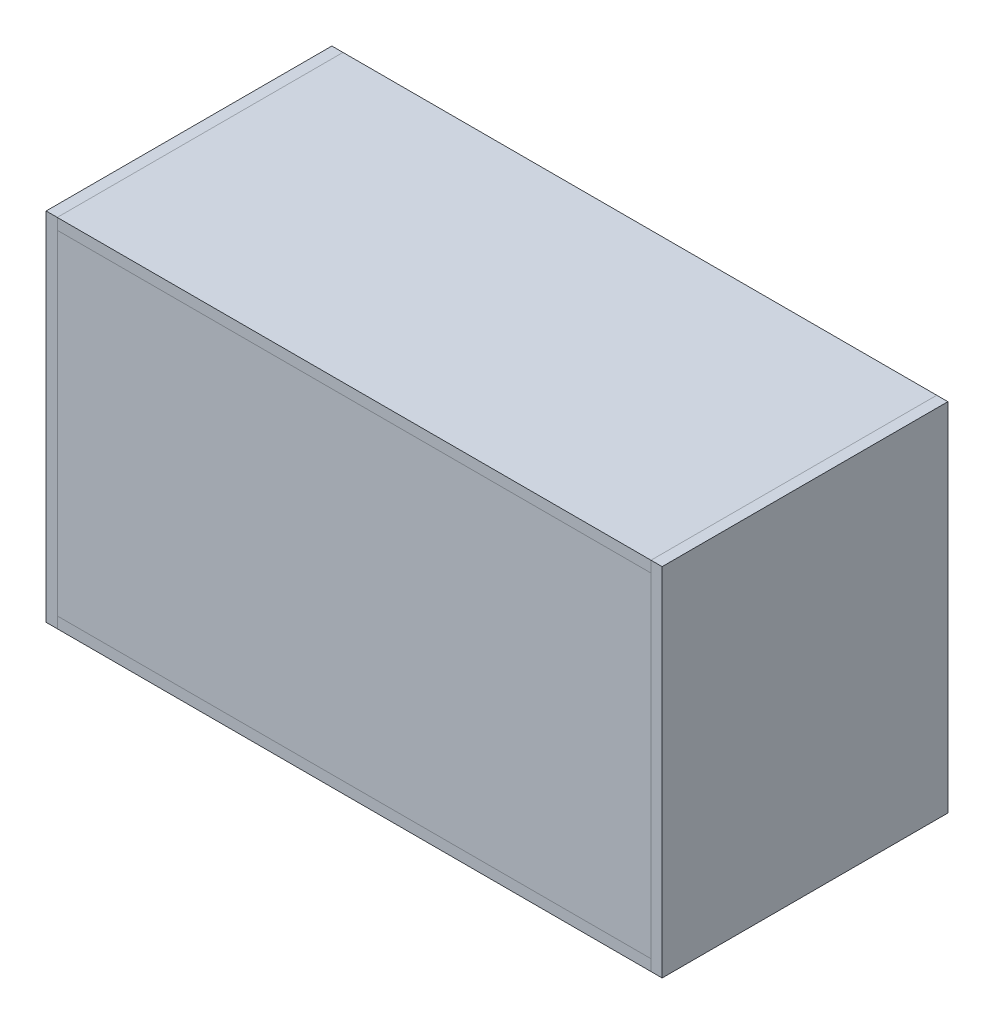
ISO-10303-21;
HEADER;
FILE_DESCRIPTION(('STEP AP214'),'2;1');
FILE_NAME('part.step','',(''),(''),'','','');
FILE_SCHEMA(('AUTOMOTIVE_DESIGN { 1 0 10303 214 1 1 1 1 }'));
ENDSEC;
DATA;
#1=APPLICATION_CONTEXT('core data for automotive mechanical design processes');
#2=APPLICATION_PROTOCOL_DEFINITION('international standard','automotive_design',2000,#1);
#3=PRODUCT_CONTEXT('',#1,'mechanical');
#4=PRODUCT('Part','Part','',(#3));
#5=PRODUCT_RELATED_PRODUCT_CATEGORY('part','',(#4));
#6=PRODUCT_DEFINITION_FORMATION('','',#4);
#7=PRODUCT_DEFINITION_CONTEXT('part definition',#1,'design');
#8=PRODUCT_DEFINITION('design','',#6,#7);
#9=PRODUCT_DEFINITION_SHAPE('','',#8);
#10=(LENGTH_UNIT() NAMED_UNIT(*) SI_UNIT(.MILLI.,.METRE.));
#11=(NAMED_UNIT(*) PLANE_ANGLE_UNIT() SI_UNIT($,.RADIAN.));
#12=(NAMED_UNIT(*) SI_UNIT($,.STERADIAN.) SOLID_ANGLE_UNIT());
#13=UNCERTAINTY_MEASURE_WITH_UNIT(LENGTH_MEASURE(1.E-05),#10,'distance_accuracy_value','');
#14=(GEOMETRIC_REPRESENTATION_CONTEXT(3) GLOBAL_UNCERTAINTY_ASSIGNED_CONTEXT((#13)) GLOBAL_UNIT_ASSIGNED_CONTEXT((#10,
#11,#12)) REPRESENTATION_CONTEXT('',''));
#15=CARTESIAN_POINT('',(0.,0.,0.));
#16=DIRECTION('',(0.,0.,1.));
#17=DIRECTION('',(1.,0.,0.));
#18=AXIS2_PLACEMENT_3D('',#15,#16,#17);
#19=CARTESIAN_POINT('',(508.,0.,-225.425));
#20=DIRECTION('',(1.,0.,0.));
#21=DIRECTION('',(0.,0.,1.));
#22=AXIS2_PLACEMENT_3D('',#19,#20,#21);
#23=PLANE('',#22);
#24=DIRECTION('',(0.,1.,0.));
#25=VECTOR('',#24,1.);
#26=CARTESIAN_POINT('',(508.,0.,-244.475));
#27=LINE('',#26,#25);
#28=CARTESIAN_POINT('',(508.,0.,-244.475));
#29=VERTEX_POINT('',#28);
#30=CARTESIAN_POINT('',(508.,571.5,-244.475));
#31=VERTEX_POINT('',#30);
#32=EDGE_CURVE('E114',#29,#31,#27,.T.);
#33=ORIENTED_EDGE('',*,*,#32,.T.);
#34=DIRECTION('',(0.,0.,-1.));
#35=VECTOR('',#34,1.);
#36=CARTESIAN_POINT('',(508.,571.5,-225.425));
#37=LINE('',#36,#35);
#38=CARTESIAN_POINT('',(508.,571.5,-225.425));
#39=VERTEX_POINT('',#38);
#40=EDGE_CURVE('E53',#39,#31,#37,.T.);
#41=ORIENTED_EDGE('',*,*,#40,.F.);
#42=DIRECTION('',(0.,1.,0.));
#43=VECTOR('',#42,1.);
#44=CARTESIAN_POINT('',(508.,0.,-225.425));
#45=LINE('',#44,#43);
#46=CARTESIAN_POINT('',(508.,0.,-225.425));
#47=VERTEX_POINT('',#46);
#48=EDGE_CURVE('E103',#47,#39,#45,.T.);
#49=ORIENTED_EDGE('',*,*,#48,.F.);
#50=DIRECTION('',(0.,0.,-1.));
#51=VECTOR('',#50,1.);
#52=CARTESIAN_POINT('',(508.,0.,-225.425));
#53=LINE('',#52,#51);
#54=EDGE_CURVE('E12',#47,#29,#53,.T.);
#55=ORIENTED_EDGE('',*,*,#54,.T.);
#56=EDGE_LOOP('',(#33,#41,#49,#55));
#57=FACE_BOUND('',#56,.T.);
#58=ADVANCED_FACE('F50',(#57),#23,.T.);
#59=CARTESIAN_POINT('',(508.,0.,-225.425));
#60=DIRECTION('',(0.,-1.,0.));
#61=DIRECTION('',(0.,0.,1.));
#62=AXIS2_PLACEMENT_3D('',#59,#60,#61);
#63=PLANE('',#62);
#64=DIRECTION('',(1.,0.,0.));
#65=VECTOR('',#64,1.);
#66=CARTESIAN_POINT('',(508.,0.,-244.475));
#67=LINE('',#66,#65);
#68=CARTESIAN_POINT('',(-508.,0.,-244.475));
#69=VERTEX_POINT('',#68);
#70=EDGE_CURVE('E91',#69,#29,#67,.T.);
#71=ORIENTED_EDGE('',*,*,#70,.T.);
#72=ORIENTED_EDGE('',*,*,#54,.F.);
#73=DIRECTION('',(1.,0.,0.));
#74=VECTOR('',#73,1.);
#75=CARTESIAN_POINT('',(508.,0.,-225.425));
#76=LINE('',#75,#74);
#77=CARTESIAN_POINT('',(-508.,0.,-225.425));
#78=VERTEX_POINT('',#77);
#79=EDGE_CURVE('E68',#78,#47,#76,.T.);
#80=ORIENTED_EDGE('',*,*,#79,.F.);
#81=DIRECTION('',(0.,0.,-1.));
#82=VECTOR('',#81,1.);
#83=CARTESIAN_POINT('',(-508.,0.,-225.425));
#84=LINE('',#83,#82);
#85=EDGE_CURVE('E59',#78,#69,#84,.T.);
#86=ORIENTED_EDGE('',*,*,#85,.T.);
#87=EDGE_LOOP('',(#71,#72,#80,#86));
#88=FACE_BOUND('',#87,.T.);
#89=ADVANCED_FACE('F120',(#88),#63,.T.);
#90=CARTESIAN_POINT('',(-508.,0.,-225.425));
#91=DIRECTION('',(-1.,0.,0.));
#92=DIRECTION('',(0.,0.,-1.));
#93=AXIS2_PLACEMENT_3D('',#90,#91,#92);
#94=PLANE('',#93);
#95=DIRECTION('',(0.,-1.,0.));
#96=VECTOR('',#95,1.);
#97=CARTESIAN_POINT('',(-508.,0.,-244.475));
#98=LINE('',#97,#96);
#99=CARTESIAN_POINT('',(-508.,571.5,-244.475));
#100=VERTEX_POINT('',#99);
#101=EDGE_CURVE('E85',#100,#69,#98,.T.);
#102=ORIENTED_EDGE('',*,*,#101,.T.);
#103=ORIENTED_EDGE('',*,*,#85,.F.);
#104=DIRECTION('',(0.,-1.,0.));
#105=VECTOR('',#104,1.);
#106=CARTESIAN_POINT('',(-508.,0.,-225.425));
#107=LINE('',#106,#105);
#108=CARTESIAN_POINT('',(-508.,571.5,-225.425));
#109=VERTEX_POINT('',#108);
#110=EDGE_CURVE('E101',#109,#78,#107,.T.);
#111=ORIENTED_EDGE('',*,*,#110,.F.);
#112=DIRECTION('',(0.,0.,-1.));
#113=VECTOR('',#112,1.);
#114=CARTESIAN_POINT('',(-508.,571.5,-225.425));
#115=LINE('',#114,#113);
#116=EDGE_CURVE('E106',#109,#100,#115,.T.);
#117=ORIENTED_EDGE('',*,*,#116,.T.);
#118=EDGE_LOOP('',(#102,#103,#111,#117));
#119=FACE_BOUND('',#118,.T.);
#120=ADVANCED_FACE('F109',(#119),#94,.T.);
#121=CARTESIAN_POINT('',(508.,571.5,-225.425));
#122=DIRECTION('',(0.,1.,0.));
#123=DIRECTION('',(-1.,0.,0.));
#124=AXIS2_PLACEMENT_3D('',#121,#122,#123);
#125=PLANE('',#124);
#126=DIRECTION('',(-1.,0.,0.));
#127=VECTOR('',#126,1.);
#128=CARTESIAN_POINT('',(508.,571.5,-244.475));
#129=LINE('',#128,#127);
#130=EDGE_CURVE('E108',#31,#100,#129,.T.);
#131=ORIENTED_EDGE('',*,*,#130,.T.);
#132=ORIENTED_EDGE('',*,*,#116,.F.);
#133=DIRECTION('',(-1.,0.,0.));
#134=VECTOR('',#133,1.);
#135=CARTESIAN_POINT('',(508.,571.5,-225.425));
#136=LINE('',#135,#134);
#137=EDGE_CURVE('E98',#39,#109,#136,.T.);
#138=ORIENTED_EDGE('',*,*,#137,.F.);
#139=ORIENTED_EDGE('',*,*,#40,.T.);
#140=EDGE_LOOP('',(#131,#132,#138,#139));
#141=FACE_BOUND('',#140,.T.);
#142=ADVANCED_FACE('F107',(#141),#125,.T.);
#143=CARTESIAN_POINT('',(0.,0.,-225.425));
#144=DIRECTION('',(0.,0.,-1.));
#145=DIRECTION('',(1.,0.,0.));
#146=AXIS2_PLACEMENT_3D('',#143,#144,#145);
#147=PLANE('',#146);
#148=ORIENTED_EDGE('',*,*,#48,.T.);
#149=ORIENTED_EDGE('',*,*,#137,.T.);
#150=ORIENTED_EDGE('',*,*,#110,.T.);
#151=ORIENTED_EDGE('',*,*,#79,.T.);
#152=EDGE_LOOP('',(#148,#149,#150,#151));
#153=FACE_BOUND('',#152,.T.);
#154=ADVANCED_FACE('F99',(#153),#147,.F.);
#155=CARTESIAN_POINT('',(0.,0.,-244.475));
#156=DIRECTION('',(0.,0.,-1.));
#157=DIRECTION('',(1.,0.,0.));
#158=AXIS2_PLACEMENT_3D('',#155,#156,#157);
#159=PLANE('',#158);
#160=ORIENTED_EDGE('',*,*,#32,.F.);
#161=ORIENTED_EDGE('',*,*,#70,.F.);
#162=ORIENTED_EDGE('',*,*,#101,.F.);
#163=ORIENTED_EDGE('',*,*,#130,.F.);
#164=EDGE_LOOP('',(#160,#161,#162,#163));
#165=FACE_BOUND('',#164,.T.);
#166=ADVANCED_FACE('F123',(#165),#159,.T.);
#167=CLOSED_SHELL('',(#58,#89,#120,#142,#154,#166));
#168=MANIFOLD_SOLID_BREP('B2',#167);
#169=CARTESIAN_POINT('',(508.,0.,225.425));
#170=DIRECTION('',(1.,0.,0.));
#171=DIRECTION('',(0.,0.,-1.));
#172=AXIS2_PLACEMENT_3D('',#169,#170,#171);
#173=PLANE('',#172);
#174=DIRECTION('',(0.,1.,0.));
#175=VECTOR('',#174,1.);
#176=CARTESIAN_POINT('',(508.,0.,244.475));
#177=LINE('',#176,#175);
#178=CARTESIAN_POINT('',(508.,0.,244.475));
#179=VERTEX_POINT('',#178);
#180=CARTESIAN_POINT('',(508.,571.5,244.475));
#181=VERTEX_POINT('',#180);
#182=EDGE_CURVE('E248',#179,#181,#177,.T.);
#183=ORIENTED_EDGE('',*,*,#182,.F.);
#184=DIRECTION('',(0.,0.,1.));
#185=VECTOR('',#184,1.);
#186=CARTESIAN_POINT('',(508.,0.,225.425));
#187=LINE('',#186,#185);
#188=CARTESIAN_POINT('',(508.,0.,225.425));
#189=VERTEX_POINT('',#188);
#190=EDGE_CURVE('E48',#189,#179,#187,.T.);
#191=ORIENTED_EDGE('',*,*,#190,.F.);
#192=DIRECTION('',(0.,1.,0.));
#193=VECTOR('',#192,1.);
#194=CARTESIAN_POINT('',(508.,0.,225.425));
#195=LINE('',#194,#193);
#196=CARTESIAN_POINT('',(508.,571.5,225.425));
#197=VERTEX_POINT('',#196);
#198=EDGE_CURVE('E242',#189,#197,#195,.T.);
#199=ORIENTED_EDGE('',*,*,#198,.T.);
#200=DIRECTION('',(0.,0.,1.));
#201=VECTOR('',#200,1.);
#202=CARTESIAN_POINT('',(508.,571.5,225.425));
#203=LINE('',#202,#201);
#204=EDGE_CURVE('E187',#197,#181,#203,.T.);
#205=ORIENTED_EDGE('',*,*,#204,.T.);
#206=EDGE_LOOP('',(#183,#191,#199,#205));
#207=FACE_BOUND('',#206,.T.);
#208=ADVANCED_FACE('F184',(#207),#173,.T.);
#209=CARTESIAN_POINT('',(508.,0.,225.425));
#210=DIRECTION('',(0.,-1.,0.));
#211=DIRECTION('',(0.,0.,-1.));
#212=AXIS2_PLACEMENT_3D('',#209,#210,#211);
#213=PLANE('',#212);
#214=DIRECTION('',(1.,0.,0.));
#215=VECTOR('',#214,1.);
#216=CARTESIAN_POINT('',(508.,0.,244.475));
#217=LINE('',#216,#215);
#218=CARTESIAN_POINT('',(-508.,0.,244.475));
#219=VERTEX_POINT('',#218);
#220=EDGE_CURVE('E244',#219,#179,#217,.T.);
#221=ORIENTED_EDGE('',*,*,#220,.F.);
#222=DIRECTION('',(0.,0.,1.));
#223=VECTOR('',#222,1.);
#224=CARTESIAN_POINT('',(-508.,0.,225.425));
#225=LINE('',#224,#223);
#226=CARTESIAN_POINT('',(-508.,0.,225.425));
#227=VERTEX_POINT('',#226);
#228=EDGE_CURVE('E193',#227,#219,#225,.T.);
#229=ORIENTED_EDGE('',*,*,#228,.F.);
#230=DIRECTION('',(1.,0.,0.));
#231=VECTOR('',#230,1.);
#232=CARTESIAN_POINT('',(508.,0.,225.425));
#233=LINE('',#232,#231);
#234=EDGE_CURVE('E239',#227,#189,#233,.T.);
#235=ORIENTED_EDGE('',*,*,#234,.T.);
#236=ORIENTED_EDGE('',*,*,#190,.T.);
#237=EDGE_LOOP('',(#221,#229,#235,#236));
#238=FACE_BOUND('',#237,.T.);
#239=ADVANCED_FACE('F258',(#238),#213,.T.);
#240=CARTESIAN_POINT('',(-508.,0.,225.425));
#241=DIRECTION('',(-1.,0.,0.));
#242=DIRECTION('',(0.,0.,1.));
#243=AXIS2_PLACEMENT_3D('',#240,#241,#242);
#244=PLANE('',#243);
#245=DIRECTION('',(0.,-1.,0.));
#246=VECTOR('',#245,1.);
#247=CARTESIAN_POINT('',(-508.,0.,244.475));
#248=LINE('',#247,#246);
#249=CARTESIAN_POINT('',(-508.,571.5,244.475));
#250=VERTEX_POINT('',#249);
#251=EDGE_CURVE('E234',#250,#219,#248,.T.);
#252=ORIENTED_EDGE('',*,*,#251,.F.);
#253=DIRECTION('',(0.,0.,1.));
#254=VECTOR('',#253,1.);
#255=CARTESIAN_POINT('',(-508.,571.5,225.425));
#256=LINE('',#255,#254);
#257=CARTESIAN_POINT('',(-508.,571.5,225.425));
#258=VERTEX_POINT('',#257);
#259=EDGE_CURVE('E229',#258,#250,#256,.T.);
#260=ORIENTED_EDGE('',*,*,#259,.F.);
#261=DIRECTION('',(0.,-1.,0.));
#262=VECTOR('',#261,1.);
#263=CARTESIAN_POINT('',(-508.,0.,225.425));
#264=LINE('',#263,#262);
#265=EDGE_CURVE('E232',#258,#227,#264,.T.);
#266=ORIENTED_EDGE('',*,*,#265,.T.);
#267=ORIENTED_EDGE('',*,*,#228,.T.);
#268=EDGE_LOOP('',(#252,#260,#266,#267));
#269=FACE_BOUND('',#268,.T.);
#270=ADVANCED_FACE('F231',(#269),#244,.T.);
#271=CARTESIAN_POINT('',(508.,571.5,225.425));
#272=DIRECTION('',(0.,1.,0.));
#273=DIRECTION('',(-1.,0.,0.));
#274=AXIS2_PLACEMENT_3D('',#271,#272,#273);
#275=PLANE('',#274);
#276=DIRECTION('',(-1.,0.,0.));
#277=VECTOR('',#276,1.);
#278=CARTESIAN_POINT('',(508.,571.5,244.475));
#279=LINE('',#278,#277);
#280=EDGE_CURVE('E251',#181,#250,#279,.T.);
#281=ORIENTED_EDGE('',*,*,#280,.F.);
#282=ORIENTED_EDGE('',*,*,#204,.F.);
#283=DIRECTION('',(-1.,0.,0.));
#284=VECTOR('',#283,1.);
#285=CARTESIAN_POINT('',(508.,571.5,225.425));
#286=LINE('',#285,#284);
#287=EDGE_CURVE('E238',#197,#258,#286,.T.);
#288=ORIENTED_EDGE('',*,*,#287,.T.);
#289=ORIENTED_EDGE('',*,*,#259,.T.);
#290=EDGE_LOOP('',(#281,#282,#288,#289));
#291=FACE_BOUND('',#290,.T.);
#292=ADVANCED_FACE('F241',(#291),#275,.T.);
#293=CARTESIAN_POINT('',(0.,0.,225.425));
#294=DIRECTION('',(0.,0.,1.));
#295=DIRECTION('',(1.,0.,0.));
#296=AXIS2_PLACEMENT_3D('',#293,#294,#295);
#297=PLANE('',#296);
#298=ORIENTED_EDGE('',*,*,#198,.F.);
#299=ORIENTED_EDGE('',*,*,#234,.F.);
#300=ORIENTED_EDGE('',*,*,#265,.F.);
#301=ORIENTED_EDGE('',*,*,#287,.F.);
#302=EDGE_LOOP('',(#298,#299,#300,#301));
#303=FACE_BOUND('',#302,.T.);
#304=ADVANCED_FACE('F237',(#303),#297,.F.);
#305=CARTESIAN_POINT('',(0.,0.,244.475));
#306=DIRECTION('',(0.,0.,1.));
#307=DIRECTION('',(1.,0.,0.));
#308=AXIS2_PLACEMENT_3D('',#305,#306,#307);
#309=PLANE('',#308);
#310=ORIENTED_EDGE('',*,*,#182,.T.);
#311=ORIENTED_EDGE('',*,*,#280,.T.);
#312=ORIENTED_EDGE('',*,*,#251,.T.);
#313=ORIENTED_EDGE('',*,*,#220,.T.);
#314=EDGE_LOOP('',(#310,#311,#312,#313));
#315=FACE_BOUND('',#314,.T.);
#316=ADVANCED_FACE('F257',(#315),#309,.T.);
#317=CLOSED_SHELL('',(#208,#239,#270,#292,#304,#316));
#318=MANIFOLD_SOLID_BREP('B6',#317);
#319=CARTESIAN_POINT('',(-508.,571.5,244.475));
#320=DIRECTION('',(-1.,0.,0.));
#321=DIRECTION('',(0.,0.,1.));
#322=AXIS2_PLACEMENT_3D('',#319,#320,#321);
#323=PLANE('',#322);
#324=DIRECTION('',(0.,0.,1.));
#325=VECTOR('',#324,1.);
#326=CARTESIAN_POINT('',(-508.,590.55,244.475));
#327=LINE('',#326,#325);
#328=CARTESIAN_POINT('',(-508.,590.55,-244.475));
#329=VERTEX_POINT('',#328);
#330=CARTESIAN_POINT('',(-508.,590.55,244.475));
#331=VERTEX_POINT('',#330);
#332=EDGE_CURVE('E382',#329,#331,#327,.T.);
#333=ORIENTED_EDGE('',*,*,#332,.F.);
#334=DIRECTION('',(0.,1.,0.));
#335=VECTOR('',#334,1.);
#336=CARTESIAN_POINT('',(-508.,571.5,-244.475));
#337=LINE('',#336,#335);
#338=CARTESIAN_POINT('',(-508.,571.5,-244.475));
#339=VERTEX_POINT('',#338);
#340=EDGE_CURVE('E182',#339,#329,#337,.T.);
#341=ORIENTED_EDGE('',*,*,#340,.F.);
#342=DIRECTION('',(0.,0.,1.));
#343=VECTOR('',#342,1.);
#344=CARTESIAN_POINT('',(-508.,571.5,244.475));
#345=LINE('',#344,#343);
#346=CARTESIAN_POINT('',(-508.,571.5,244.475));
#347=VERTEX_POINT('',#346);
#348=EDGE_CURVE('E376',#339,#347,#345,.T.);
#349=ORIENTED_EDGE('',*,*,#348,.T.);
#350=DIRECTION('',(0.,1.,0.));
#351=VECTOR('',#350,1.);
#352=CARTESIAN_POINT('',(-508.,571.5,244.475));
#353=LINE('',#352,#351);
#354=EDGE_CURVE('E321',#347,#331,#353,.T.);
#355=ORIENTED_EDGE('',*,*,#354,.T.);
#356=EDGE_LOOP('',(#333,#341,#349,#355));
#357=FACE_BOUND('',#356,.T.);
#358=ADVANCED_FACE('F318',(#357),#323,.T.);
#359=CARTESIAN_POINT('',(-508.,571.5,-244.475));
#360=DIRECTION('',(0.,0.,-1.));
#361=DIRECTION('',(-1.,0.,0.));
#362=AXIS2_PLACEMENT_3D('',#359,#360,#361);
#363=PLANE('',#362);
#364=DIRECTION('',(-1.,0.,0.));
#365=VECTOR('',#364,1.);
#366=CARTESIAN_POINT('',(-508.,590.55,-244.475));
#367=LINE('',#366,#365);
#368=CARTESIAN_POINT('',(508.,590.55,-244.475));
#369=VERTEX_POINT('',#368);
#370=EDGE_CURVE('E378',#369,#329,#367,.T.);
#371=ORIENTED_EDGE('',*,*,#370,.F.);
#372=DIRECTION('',(0.,1.,0.));
#373=VECTOR('',#372,1.);
#374=CARTESIAN_POINT('',(508.,571.5,-244.475));
#375=LINE('',#374,#373);
#376=CARTESIAN_POINT('',(508.,571.5,-244.475));
#377=VERTEX_POINT('',#376);
#378=EDGE_CURVE('E327',#377,#369,#375,.T.);
#379=ORIENTED_EDGE('',*,*,#378,.F.);
#380=DIRECTION('',(-1.,0.,0.));
#381=VECTOR('',#380,1.);
#382=CARTESIAN_POINT('',(-508.,571.5,-244.475));
#383=LINE('',#382,#381);
#384=EDGE_CURVE('E373',#377,#339,#383,.T.);
#385=ORIENTED_EDGE('',*,*,#384,.T.);
#386=ORIENTED_EDGE('',*,*,#340,.T.);
#387=EDGE_LOOP('',(#371,#379,#385,#386));
#388=FACE_BOUND('',#387,.T.);
#389=ADVANCED_FACE('F392',(#388),#363,.T.);
#390=CARTESIAN_POINT('',(508.,571.5,244.475));
#391=DIRECTION('',(1.,0.,0.));
#392=DIRECTION('',(0.,0.,-1.));
#393=AXIS2_PLACEMENT_3D('',#390,#391,#392);
#394=PLANE('',#393);
#395=DIRECTION('',(0.,0.,-1.));
#396=VECTOR('',#395,1.);
#397=CARTESIAN_POINT('',(508.,590.55,244.475));
#398=LINE('',#397,#396);
#399=CARTESIAN_POINT('',(508.,590.55,244.475));
#400=VERTEX_POINT('',#399);
#401=EDGE_CURVE('E368',#400,#369,#398,.T.);
#402=ORIENTED_EDGE('',*,*,#401,.F.);
#403=DIRECTION('',(0.,1.,0.));
#404=VECTOR('',#403,1.);
#405=CARTESIAN_POINT('',(508.,571.5,244.475));
#406=LINE('',#405,#404);
#407=CARTESIAN_POINT('',(508.,571.5,244.475));
#408=VERTEX_POINT('',#407);
#409=EDGE_CURVE('E363',#408,#400,#406,.T.);
#410=ORIENTED_EDGE('',*,*,#409,.F.);
#411=DIRECTION('',(0.,0.,-1.));
#412=VECTOR('',#411,1.);
#413=CARTESIAN_POINT('',(508.,571.5,244.475));
#414=LINE('',#413,#412);
#415=EDGE_CURVE('E366',#408,#377,#414,.T.);
#416=ORIENTED_EDGE('',*,*,#415,.T.);
#417=ORIENTED_EDGE('',*,*,#378,.T.);
#418=EDGE_LOOP('',(#402,#410,#416,#417));
#419=FACE_BOUND('',#418,.T.);
#420=ADVANCED_FACE('F365',(#419),#394,.T.);
#421=CARTESIAN_POINT('',(-508.,571.5,244.475));
#422=DIRECTION('',(0.,0.,1.));
#423=DIRECTION('',(1.,0.,0.));
#424=AXIS2_PLACEMENT_3D('',#421,#422,#423);
#425=PLANE('',#424);
#426=DIRECTION('',(1.,0.,0.));
#427=VECTOR('',#426,1.);
#428=CARTESIAN_POINT('',(-508.,590.55,244.475));
#429=LINE('',#428,#427);
#430=EDGE_CURVE('E385',#331,#400,#429,.T.);
#431=ORIENTED_EDGE('',*,*,#430,.F.);
#432=ORIENTED_EDGE('',*,*,#354,.F.);
#433=DIRECTION('',(1.,0.,0.));
#434=VECTOR('',#433,1.);
#435=CARTESIAN_POINT('',(-508.,571.5,244.475));
#436=LINE('',#435,#434);
#437=EDGE_CURVE('E372',#347,#408,#436,.T.);
#438=ORIENTED_EDGE('',*,*,#437,.T.);
#439=ORIENTED_EDGE('',*,*,#409,.T.);
#440=EDGE_LOOP('',(#431,#432,#438,#439));
#441=FACE_BOUND('',#440,.T.);
#442=ADVANCED_FACE('F375',(#441),#425,.T.);
#443=CARTESIAN_POINT('',(0.,571.5,0.));
#444=DIRECTION('',(0.,-1.,0.));
#445=DIRECTION('',(0.,0.,-1.));
#446=AXIS2_PLACEMENT_3D('',#443,#444,#445);
#447=PLANE('',#446);
#448=ORIENTED_EDGE('',*,*,#348,.F.);
#449=ORIENTED_EDGE('',*,*,#384,.F.);
#450=ORIENTED_EDGE('',*,*,#415,.F.);
#451=ORIENTED_EDGE('',*,*,#437,.F.);
#452=EDGE_LOOP('',(#448,#449,#450,#451));
#453=FACE_BOUND('',#452,.T.);
#454=ADVANCED_FACE('F371',(#453),#447,.T.);
#455=CARTESIAN_POINT('',(0.,590.55,0.));
#456=DIRECTION('',(0.,-1.,0.));
#457=DIRECTION('',(0.,0.,-1.));
#458=AXIS2_PLACEMENT_3D('',#455,#456,#457);
#459=PLANE('',#458);
#460=ORIENTED_EDGE('',*,*,#332,.T.);
#461=ORIENTED_EDGE('',*,*,#430,.T.);
#462=ORIENTED_EDGE('',*,*,#401,.T.);
#463=ORIENTED_EDGE('',*,*,#370,.T.);
#464=EDGE_LOOP('',(#460,#461,#462,#463));
#465=FACE_BOUND('',#464,.T.);
#466=ADVANCED_FACE('F391',(#465),#459,.F.);
#467=CLOSED_SHELL('',(#358,#389,#420,#442,#454,#466));
#468=MANIFOLD_SOLID_BREP('B42',#467);
#469=CARTESIAN_POINT('',(527.05,590.55,-244.475));
#470=DIRECTION('',(0.,-1.,0.));
#471=DIRECTION('',(0.,0.,-1.));
#472=AXIS2_PLACEMENT_3D('',#469,#470,#471);
#473=PLANE('',#472);
#474=DIRECTION('',(0.,0.,-1.));
#475=VECTOR('',#474,1.);
#476=CARTESIAN_POINT('',(508.,590.55,-244.475));
#477=LINE('',#476,#475);
#478=CARTESIAN_POINT('',(508.,590.55,244.475));
#479=VERTEX_POINT('',#478);
#480=CARTESIAN_POINT('',(508.,590.55,-244.475));
#481=VERTEX_POINT('',#480);
#482=EDGE_CURVE('E515',#479,#481,#477,.T.);
#483=ORIENTED_EDGE('',*,*,#482,.F.);
#484=DIRECTION('',(-1.,0.,0.));
#485=VECTOR('',#484,1.);
#486=CARTESIAN_POINT('',(527.05,590.55,244.475));
#487=LINE('',#486,#485);
#488=CARTESIAN_POINT('',(527.05,590.55,244.475));
#489=VERTEX_POINT('',#488);
#490=EDGE_CURVE('E514',#489,#479,#487,.T.);
#491=ORIENTED_EDGE('',*,*,#490,.F.);
#492=DIRECTION('',(0.,0.,-1.));
#493=VECTOR('',#492,1.);
#494=CARTESIAN_POINT('',(527.05,590.55,-244.475));
#495=LINE('',#494,#493);
#496=CARTESIAN_POINT('',(527.05,590.55,-244.475));
#497=VERTEX_POINT('',#496);
#498=EDGE_CURVE('E509',#489,#497,#495,.T.);
#499=ORIENTED_EDGE('',*,*,#498,.T.);
#500=DIRECTION('',(-1.,0.,0.));
#501=VECTOR('',#500,1.);
#502=CARTESIAN_POINT('',(527.05,590.55,-244.475));
#503=LINE('',#502,#501);
#504=EDGE_CURVE('E316',#497,#481,#503,.T.);
#505=ORIENTED_EDGE('',*,*,#504,.T.);
#506=EDGE_LOOP('',(#483,#491,#499,#505));
#507=FACE_BOUND('',#506,.T.);
#508=ADVANCED_FACE('F452',(#507),#473,.F.);
#509=CARTESIAN_POINT('',(527.05,590.55,-244.475));
#510=DIRECTION('',(0.,0.,1.));
#511=DIRECTION('',(0.,-1.,0.));
#512=AXIS2_PLACEMENT_3D('',#509,#510,#511);
#513=PLANE('',#512);
#514=DIRECTION('',(0.,-1.,0.));
#515=VECTOR('',#514,1.);
#516=CARTESIAN_POINT('',(508.,590.55,-244.475));
#517=LINE('',#516,#515);
#518=CARTESIAN_POINT('',(508.,-19.05,-244.475));
#519=VERTEX_POINT('',#518);
#520=EDGE_CURVE('E517',#481,#519,#517,.T.);
#521=ORIENTED_EDGE('',*,*,#520,.F.);
#522=ORIENTED_EDGE('',*,*,#504,.F.);
#523=DIRECTION('',(0.,-1.,0.));
#524=VECTOR('',#523,1.);
#525=CARTESIAN_POINT('',(527.05,590.55,-244.475));
#526=LINE('',#525,#524);
#527=CARTESIAN_POINT('',(527.05,-19.05,-244.475));
#528=VERTEX_POINT('',#527);
#529=EDGE_CURVE('E493',#497,#528,#526,.T.);
#530=ORIENTED_EDGE('',*,*,#529,.T.);
#531=DIRECTION('',(-1.,0.,0.));
#532=VECTOR('',#531,1.);
#533=CARTESIAN_POINT('',(527.05,-19.05,-244.475));
#534=LINE('',#533,#532);
#535=EDGE_CURVE('E460',#528,#519,#534,.T.);
#536=ORIENTED_EDGE('',*,*,#535,.T.);
#537=EDGE_LOOP('',(#521,#522,#530,#536));
#538=FACE_BOUND('',#537,.T.);
#539=ADVANCED_FACE('F507',(#538),#513,.F.);
#540=CARTESIAN_POINT('',(527.05,-19.05,-244.475));
#541=DIRECTION('',(0.,1.,0.));
#542=DIRECTION('',(0.,0.,1.));
#543=AXIS2_PLACEMENT_3D('',#540,#541,#542);
#544=PLANE('',#543);
#545=DIRECTION('',(0.,0.,1.));
#546=VECTOR('',#545,1.);
#547=CARTESIAN_POINT('',(508.,-19.05,-244.475));
#548=LINE('',#547,#546);
#549=CARTESIAN_POINT('',(508.,-19.05,244.475));
#550=VERTEX_POINT('',#549);
#551=EDGE_CURVE('E503',#519,#550,#548,.T.);
#552=ORIENTED_EDGE('',*,*,#551,.F.);
#553=ORIENTED_EDGE('',*,*,#535,.F.);
#554=DIRECTION('',(0.,0.,1.));
#555=VECTOR('',#554,1.);
#556=CARTESIAN_POINT('',(527.05,-19.05,-244.475));
#557=LINE('',#556,#555);
#558=CARTESIAN_POINT('',(527.05,-19.05,244.475));
#559=VERTEX_POINT('',#558);
#560=EDGE_CURVE('E496',#528,#559,#557,.T.);
#561=ORIENTED_EDGE('',*,*,#560,.T.);
#562=DIRECTION('',(-1.,0.,0.));
#563=VECTOR('',#562,1.);
#564=CARTESIAN_POINT('',(527.05,-19.05,244.475));
#565=LINE('',#564,#563);
#566=EDGE_CURVE('E506',#559,#550,#565,.T.);
#567=ORIENTED_EDGE('',*,*,#566,.T.);
#568=EDGE_LOOP('',(#552,#553,#561,#567));
#569=FACE_BOUND('',#568,.T.);
#570=ADVANCED_FACE('F502',(#569),#544,.F.);
#571=CARTESIAN_POINT('',(527.05,590.55,244.475));
#572=DIRECTION('',(0.,0.,-1.));
#573=DIRECTION('',(0.,1.,0.));
#574=AXIS2_PLACEMENT_3D('',#571,#572,#573);
#575=PLANE('',#574);
#576=DIRECTION('',(0.,1.,0.));
#577=VECTOR('',#576,1.);
#578=CARTESIAN_POINT('',(508.,590.55,244.475));
#579=LINE('',#578,#577);
#580=EDGE_CURVE('E482',#550,#479,#579,.T.);
#581=ORIENTED_EDGE('',*,*,#580,.F.);
#582=ORIENTED_EDGE('',*,*,#566,.F.);
#583=DIRECTION('',(0.,1.,0.));
#584=VECTOR('',#583,1.);
#585=CARTESIAN_POINT('',(527.05,590.55,244.475));
#586=LINE('',#585,#584);
#587=EDGE_CURVE('E468',#559,#489,#586,.T.);
#588=ORIENTED_EDGE('',*,*,#587,.T.);
#589=ORIENTED_EDGE('',*,*,#490,.T.);
#590=EDGE_LOOP('',(#581,#582,#588,#589));
#591=FACE_BOUND('',#590,.T.);
#592=ADVANCED_FACE('F526',(#591),#575,.F.);
#593=CARTESIAN_POINT('',(527.05,0.,0.));
#594=DIRECTION('',(-1.,0.,0.));
#595=DIRECTION('',(0.,0.,-1.));
#596=AXIS2_PLACEMENT_3D('',#593,#594,#595);
#597=PLANE('',#596);
#598=ORIENTED_EDGE('',*,*,#498,.F.);
#599=ORIENTED_EDGE('',*,*,#587,.F.);
#600=ORIENTED_EDGE('',*,*,#560,.F.);
#601=ORIENTED_EDGE('',*,*,#529,.F.);
#602=EDGE_LOOP('',(#598,#599,#600,#601));
#603=FACE_BOUND('',#602,.T.);
#604=ADVANCED_FACE('F498',(#603),#597,.F.);
#605=CARTESIAN_POINT('',(508.,0.,0.));
#606=DIRECTION('',(-1.,0.,0.));
#607=DIRECTION('',(0.,0.,-1.));
#608=AXIS2_PLACEMENT_3D('',#605,#606,#607);
#609=PLANE('',#608);
#610=ORIENTED_EDGE('',*,*,#482,.T.);
#611=ORIENTED_EDGE('',*,*,#520,.T.);
#612=ORIENTED_EDGE('',*,*,#551,.T.);
#613=ORIENTED_EDGE('',*,*,#580,.T.);
#614=EDGE_LOOP('',(#610,#611,#612,#613));
#615=FACE_BOUND('',#614,.T.);
#616=ADVANCED_FACE('F522',(#615),#609,.T.);
#617=CLOSED_SHELL('',(#508,#539,#570,#592,#604,#616));
#618=MANIFOLD_SOLID_BREP('B176',#617);
#619=CARTESIAN_POINT('',(-527.05,590.55,-244.475));
#620=DIRECTION('',(0.,-1.,0.));
#621=DIRECTION('',(0.,0.,-1.));
#622=AXIS2_PLACEMENT_3D('',#619,#620,#621);
#623=PLANE('',#622);
#624=DIRECTION('',(0.,0.,-1.));
#625=VECTOR('',#624,1.);
#626=CARTESIAN_POINT('',(-508.,590.55,-244.475));
#627=LINE('',#626,#625);
#628=CARTESIAN_POINT('',(-508.,590.55,244.475));
#629=VERTEX_POINT('',#628);
#630=CARTESIAN_POINT('',(-508.,590.55,-244.475));
#631=VERTEX_POINT('',#630);
#632=EDGE_CURVE('E648',#629,#631,#627,.T.);
#633=ORIENTED_EDGE('',*,*,#632,.T.);
#634=DIRECTION('',(1.,0.,0.));
#635=VECTOR('',#634,1.);
#636=CARTESIAN_POINT('',(-527.05,590.55,-244.475));
#637=LINE('',#636,#635);
#638=CARTESIAN_POINT('',(-527.05,590.55,-244.475));
#639=VERTEX_POINT('',#638);
#640=EDGE_CURVE('E450',#639,#631,#637,.T.);
#641=ORIENTED_EDGE('',*,*,#640,.F.);
#642=DIRECTION('',(0.,0.,-1.));
#643=VECTOR('',#642,1.);
#644=CARTESIAN_POINT('',(-527.05,590.55,-244.475));
#645=LINE('',#644,#643);
#646=CARTESIAN_POINT('',(-527.05,590.55,244.475));
#647=VERTEX_POINT('',#646);
#648=EDGE_CURVE('E636',#647,#639,#645,.T.);
#649=ORIENTED_EDGE('',*,*,#648,.F.);
#650=DIRECTION('',(1.,0.,0.));
#651=VECTOR('',#650,1.);
#652=CARTESIAN_POINT('',(-527.05,590.55,244.475));
#653=LINE('',#652,#651);
#654=EDGE_CURVE('E644',#647,#629,#653,.T.);
#655=ORIENTED_EDGE('',*,*,#654,.T.);
#656=EDGE_LOOP('',(#633,#641,#649,#655));
#657=FACE_BOUND('',#656,.T.);
#658=ADVANCED_FACE('F585',(#657),#623,.F.);
#659=CARTESIAN_POINT('',(-527.05,590.55,-244.475));
#660=DIRECTION('',(0.,0.,1.));
#661=DIRECTION('',(0.,-1.,0.));
#662=AXIS2_PLACEMENT_3D('',#659,#660,#661);
#663=PLANE('',#662);
#664=DIRECTION('',(0.,-1.,0.));
#665=VECTOR('',#664,1.);
#666=CARTESIAN_POINT('',(-508.,590.55,-244.475));
#667=LINE('',#666,#665);
#668=CARTESIAN_POINT('',(-508.,-19.05,-244.475));
#669=VERTEX_POINT('',#668);
#670=EDGE_CURVE('E640',#631,#669,#667,.T.);
#671=ORIENTED_EDGE('',*,*,#670,.T.);
#672=DIRECTION('',(1.,0.,0.));
#673=VECTOR('',#672,1.);
#674=CARTESIAN_POINT('',(-527.05,-19.05,-244.475));
#675=LINE('',#674,#673);
#676=CARTESIAN_POINT('',(-527.05,-19.05,-244.475));
#677=VERTEX_POINT('',#676);
#678=EDGE_CURVE('E593',#677,#669,#675,.T.);
#679=ORIENTED_EDGE('',*,*,#678,.F.);
#680=DIRECTION('',(0.,-1.,0.));
#681=VECTOR('',#680,1.);
#682=CARTESIAN_POINT('',(-527.05,590.55,-244.475));
#683=LINE('',#682,#681);
#684=EDGE_CURVE('E631',#639,#677,#683,.T.);
#685=ORIENTED_EDGE('',*,*,#684,.F.);
#686=ORIENTED_EDGE('',*,*,#640,.T.);
#687=EDGE_LOOP('',(#671,#679,#685,#686));
#688=FACE_BOUND('',#687,.T.);
#689=ADVANCED_FACE('F639',(#688),#663,.F.);
#690=CARTESIAN_POINT('',(-527.05,-19.05,-244.475));
#691=DIRECTION('',(0.,1.,0.));
#692=DIRECTION('',(0.,0.,1.));
#693=AXIS2_PLACEMENT_3D('',#690,#691,#692);
#694=PLANE('',#693);
#695=DIRECTION('',(0.,0.,1.));
#696=VECTOR('',#695,1.);
#697=CARTESIAN_POINT('',(-508.,-19.05,-244.475));
#698=LINE('',#697,#696);
#699=CARTESIAN_POINT('',(-508.,-19.05,244.475));
#700=VERTEX_POINT('',#699);
#701=EDGE_CURVE('E618',#669,#700,#698,.T.);
#702=ORIENTED_EDGE('',*,*,#701,.T.);
#703=DIRECTION('',(1.,0.,0.));
#704=VECTOR('',#703,1.);
#705=CARTESIAN_POINT('',(-527.05,-19.05,244.475));
#706=LINE('',#705,#704);
#707=CARTESIAN_POINT('',(-527.05,-19.05,244.475));
#708=VERTEX_POINT('',#707);
#709=EDGE_CURVE('E641',#708,#700,#706,.T.);
#710=ORIENTED_EDGE('',*,*,#709,.F.);
#711=DIRECTION('',(0.,0.,1.));
#712=VECTOR('',#711,1.);
#713=CARTESIAN_POINT('',(-527.05,-19.05,-244.475));
#714=LINE('',#713,#712);
#715=EDGE_CURVE('E634',#677,#708,#714,.T.);
#716=ORIENTED_EDGE('',*,*,#715,.F.);
#717=ORIENTED_EDGE('',*,*,#678,.T.);
#718=EDGE_LOOP('',(#702,#710,#716,#717));
#719=FACE_BOUND('',#718,.T.);
#720=ADVANCED_FACE('F642',(#719),#694,.F.);
#721=CARTESIAN_POINT('',(-527.05,590.55,244.475));
#722=DIRECTION('',(0.,0.,-1.));
#723=DIRECTION('',(0.,1.,0.));
#724=AXIS2_PLACEMENT_3D('',#721,#722,#723);
#725=PLANE('',#724);
#726=DIRECTION('',(0.,1.,0.));
#727=VECTOR('',#726,1.);
#728=CARTESIAN_POINT('',(-508.,590.55,244.475));
#729=LINE('',#728,#727);
#730=EDGE_CURVE('E624',#700,#629,#729,.T.);
#731=ORIENTED_EDGE('',*,*,#730,.T.);
#732=ORIENTED_EDGE('',*,*,#654,.F.);
#733=DIRECTION('',(0.,1.,0.));
#734=VECTOR('',#733,1.);
#735=CARTESIAN_POINT('',(-527.05,590.55,244.475));
#736=LINE('',#735,#734);
#737=EDGE_CURVE('E601',#708,#647,#736,.T.);
#738=ORIENTED_EDGE('',*,*,#737,.F.);
#739=ORIENTED_EDGE('',*,*,#709,.T.);
#740=EDGE_LOOP('',(#731,#732,#738,#739));
#741=FACE_BOUND('',#740,.T.);
#742=ADVANCED_FACE('F655',(#741),#725,.F.);
#743=CARTESIAN_POINT('',(-527.05,0.,0.));
#744=DIRECTION('',(1.,0.,0.));
#745=DIRECTION('',(0.,0.,-1.));
#746=AXIS2_PLACEMENT_3D('',#743,#744,#745);
#747=PLANE('',#746);
#748=ORIENTED_EDGE('',*,*,#648,.T.);
#749=ORIENTED_EDGE('',*,*,#684,.T.);
#750=ORIENTED_EDGE('',*,*,#715,.T.);
#751=ORIENTED_EDGE('',*,*,#737,.T.);
#752=EDGE_LOOP('',(#748,#749,#750,#751));
#753=FACE_BOUND('',#752,.T.);
#754=ADVANCED_FACE('F632',(#753),#747,.F.);
#755=CARTESIAN_POINT('',(-508.,0.,0.));
#756=DIRECTION('',(1.,0.,0.));
#757=DIRECTION('',(0.,0.,-1.));
#758=AXIS2_PLACEMENT_3D('',#755,#756,#757);
#759=PLANE('',#758);
#760=ORIENTED_EDGE('',*,*,#632,.F.);
#761=ORIENTED_EDGE('',*,*,#730,.F.);
#762=ORIENTED_EDGE('',*,*,#701,.F.);
#763=ORIENTED_EDGE('',*,*,#670,.F.);
#764=EDGE_LOOP('',(#760,#761,#762,#763));
#765=FACE_BOUND('',#764,.T.);
#766=ADVANCED_FACE('F658',(#765),#759,.T.);
#767=CLOSED_SHELL('',(#658,#689,#720,#742,#754,#766));
#768=MANIFOLD_SOLID_BREP('B310',#767);
#769=CARTESIAN_POINT('',(508.,-19.05,244.475));
#770=DIRECTION('',(1.,0.,0.));
#771=DIRECTION('',(0.,0.,-1.));
#772=AXIS2_PLACEMENT_3D('',#769,#770,#771);
#773=PLANE('',#772);
#774=DIRECTION('',(0.,0.,-1.));
#775=VECTOR('',#774,1.);
#776=CARTESIAN_POINT('',(508.,0.,244.475));
#777=LINE('',#776,#775);
#778=CARTESIAN_POINT('',(508.,0.,244.475));
#779=VERTEX_POINT('',#778);
#780=CARTESIAN_POINT('',(508.,0.,-244.475));
#781=VERTEX_POINT('',#780);
#782=EDGE_CURVE('E773',#779,#781,#777,.T.);
#783=ORIENTED_EDGE('',*,*,#782,.F.);
#784=DIRECTION('',(0.,1.,0.));
#785=VECTOR('',#784,1.);
#786=CARTESIAN_POINT('',(508.,-19.05,244.475));
#787=LINE('',#786,#785);
#788=CARTESIAN_POINT('',(508.,-19.05,244.475));
#789=VERTEX_POINT('',#788);
#790=EDGE_CURVE('E583',#789,#779,#787,.T.);
#791=ORIENTED_EDGE('',*,*,#790,.F.);
#792=DIRECTION('',(0.,0.,-1.));
#793=VECTOR('',#792,1.);
#794=CARTESIAN_POINT('',(508.,-19.05,244.475));
#795=LINE('',#794,#793);
#796=CARTESIAN_POINT('',(508.,-19.05,-244.475));
#797=VERTEX_POINT('',#796);
#798=EDGE_CURVE('E767',#789,#797,#795,.T.);
#799=ORIENTED_EDGE('',*,*,#798,.T.);
#800=DIRECTION('',(0.,1.,0.));
#801=VECTOR('',#800,1.);
#802=CARTESIAN_POINT('',(508.,-19.05,-244.475));
#803=LINE('',#802,#801);
#804=EDGE_CURVE('E712',#797,#781,#803,.T.);
#805=ORIENTED_EDGE('',*,*,#804,.T.);
#806=EDGE_LOOP('',(#783,#791,#799,#805));
#807=FACE_BOUND('',#806,.T.);
#808=ADVANCED_FACE('F709',(#807),#773,.T.);
#809=CARTESIAN_POINT('',(-508.,-19.05,244.475));
#810=DIRECTION('',(0.,0.,1.));
#811=DIRECTION('',(1.,0.,0.));
#812=AXIS2_PLACEMENT_3D('',#809,#810,#811);
#813=PLANE('',#812);
#814=DIRECTION('',(1.,0.,0.));
#815=VECTOR('',#814,1.);
#816=CARTESIAN_POINT('',(-508.,0.,244.475));
#817=LINE('',#816,#815);
#818=CARTESIAN_POINT('',(-508.,0.,244.475));
#819=VERTEX_POINT('',#818);
#820=EDGE_CURVE('E769',#819,#779,#817,.T.);
#821=ORIENTED_EDGE('',*,*,#820,.F.);
#822=DIRECTION('',(0.,1.,0.));
#823=VECTOR('',#822,1.);
#824=CARTESIAN_POINT('',(-508.,-19.05,244.475));
#825=LINE('',#824,#823);
#826=CARTESIAN_POINT('',(-508.,-19.05,244.475));
#827=VERTEX_POINT('',#826);
#828=EDGE_CURVE('E718',#827,#819,#825,.T.);
#829=ORIENTED_EDGE('',*,*,#828,.F.);
#830=DIRECTION('',(1.,0.,0.));
#831=VECTOR('',#830,1.);
#832=CARTESIAN_POINT('',(-508.,-19.05,244.475));
#833=LINE('',#832,#831);
#834=EDGE_CURVE('E764',#827,#789,#833,.T.);
#835=ORIENTED_EDGE('',*,*,#834,.T.);
#836=ORIENTED_EDGE('',*,*,#790,.T.);
#837=EDGE_LOOP('',(#821,#829,#835,#836));
#838=FACE_BOUND('',#837,.T.);
#839=ADVANCED_FACE('F783',(#838),#813,.T.);
#840=CARTESIAN_POINT('',(-508.,-19.05,244.475));
#841=DIRECTION('',(-1.,0.,0.));
#842=DIRECTION('',(0.,0.,1.));
#843=AXIS2_PLACEMENT_3D('',#840,#841,#842);
#844=PLANE('',#843);
#845=DIRECTION('',(0.,0.,1.));
#846=VECTOR('',#845,1.);
#847=CARTESIAN_POINT('',(-508.,0.,244.475));
#848=LINE('',#847,#846);
#849=CARTESIAN_POINT('',(-508.,0.,-244.475));
#850=VERTEX_POINT('',#849);
#851=EDGE_CURVE('E759',#850,#819,#848,.T.);
#852=ORIENTED_EDGE('',*,*,#851,.F.);
#853=DIRECTION('',(0.,1.,0.));
#854=VECTOR('',#853,1.);
#855=CARTESIAN_POINT('',(-508.,-19.05,-244.475));
#856=LINE('',#855,#854);
#857=CARTESIAN_POINT('',(-508.,-19.05,-244.475));
#858=VERTEX_POINT('',#857);
#859=EDGE_CURVE('E754',#858,#850,#856,.T.);
#860=ORIENTED_EDGE('',*,*,#859,.F.);
#861=DIRECTION('',(0.,0.,1.));
#862=VECTOR('',#861,1.);
#863=CARTESIAN_POINT('',(-508.,-19.05,244.475));
#864=LINE('',#863,#862);
#865=EDGE_CURVE('E757',#858,#827,#864,.T.);
#866=ORIENTED_EDGE('',*,*,#865,.T.);
#867=ORIENTED_EDGE('',*,*,#828,.T.);
#868=EDGE_LOOP('',(#852,#860,#866,#867));
#869=FACE_BOUND('',#868,.T.);
#870=ADVANCED_FACE('F756',(#869),#844,.T.);
#871=CARTESIAN_POINT('',(-508.,-19.05,-244.475));
#872=DIRECTION('',(0.,0.,-1.));
#873=DIRECTION('',(-1.,0.,0.));
#874=AXIS2_PLACEMENT_3D('',#871,#872,#873);
#875=PLANE('',#874);
#876=DIRECTION('',(-1.,0.,0.));
#877=VECTOR('',#876,1.);
#878=CARTESIAN_POINT('',(-508.,0.,-244.475));
#879=LINE('',#878,#877);
#880=EDGE_CURVE('E776',#781,#850,#879,.T.);
#881=ORIENTED_EDGE('',*,*,#880,.F.);
#882=ORIENTED_EDGE('',*,*,#804,.F.);
#883=DIRECTION('',(-1.,0.,0.));
#884=VECTOR('',#883,1.);
#885=CARTESIAN_POINT('',(-508.,-19.05,-244.475));
#886=LINE('',#885,#884);
#887=EDGE_CURVE('E763',#797,#858,#886,.T.);
#888=ORIENTED_EDGE('',*,*,#887,.T.);
#889=ORIENTED_EDGE('',*,*,#859,.T.);
#890=EDGE_LOOP('',(#881,#882,#888,#889));
#891=FACE_BOUND('',#890,.T.);
#892=ADVANCED_FACE('F766',(#891),#875,.T.);
#893=CARTESIAN_POINT('',(0.,-19.05,0.));
#894=DIRECTION('',(0.,-1.,0.));
#895=DIRECTION('',(0.,0.,-1.));
#896=AXIS2_PLACEMENT_3D('',#893,#894,#895);
#897=PLANE('',#896);
#898=ORIENTED_EDGE('',*,*,#798,.F.);
#899=ORIENTED_EDGE('',*,*,#834,.F.);
#900=ORIENTED_EDGE('',*,*,#865,.F.);
#901=ORIENTED_EDGE('',*,*,#887,.F.);
#902=EDGE_LOOP('',(#898,#899,#900,#901));
#903=FACE_BOUND('',#902,.T.);
#904=ADVANCED_FACE('F762',(#903),#897,.T.);
#905=CARTESIAN_POINT('',(0.,0.,0.));
#906=DIRECTION('',(0.,-1.,0.));
#907=DIRECTION('',(0.,0.,-1.));
#908=AXIS2_PLACEMENT_3D('',#905,#906,#907);
#909=PLANE('',#908);
#910=ORIENTED_EDGE('',*,*,#782,.T.);
#911=ORIENTED_EDGE('',*,*,#880,.T.);
#912=ORIENTED_EDGE('',*,*,#851,.T.);
#913=ORIENTED_EDGE('',*,*,#820,.T.);
#914=EDGE_LOOP('',(#910,#911,#912,#913));
#915=FACE_BOUND('',#914,.T.);
#916=ADVANCED_FACE('F782',(#915),#909,.F.);
#917=CLOSED_SHELL('',(#808,#839,#870,#892,#904,#916));
#918=MANIFOLD_SOLID_BREP('B444',#917);
#919=ADVANCED_BREP_SHAPE_REPRESENTATION('',(#18,#168,#318,#468,#618,#768,#918),#14);
#920=SHAPE_DEFINITION_REPRESENTATION(#9,#919);
ENDSEC;
END-ISO-10303-21;
